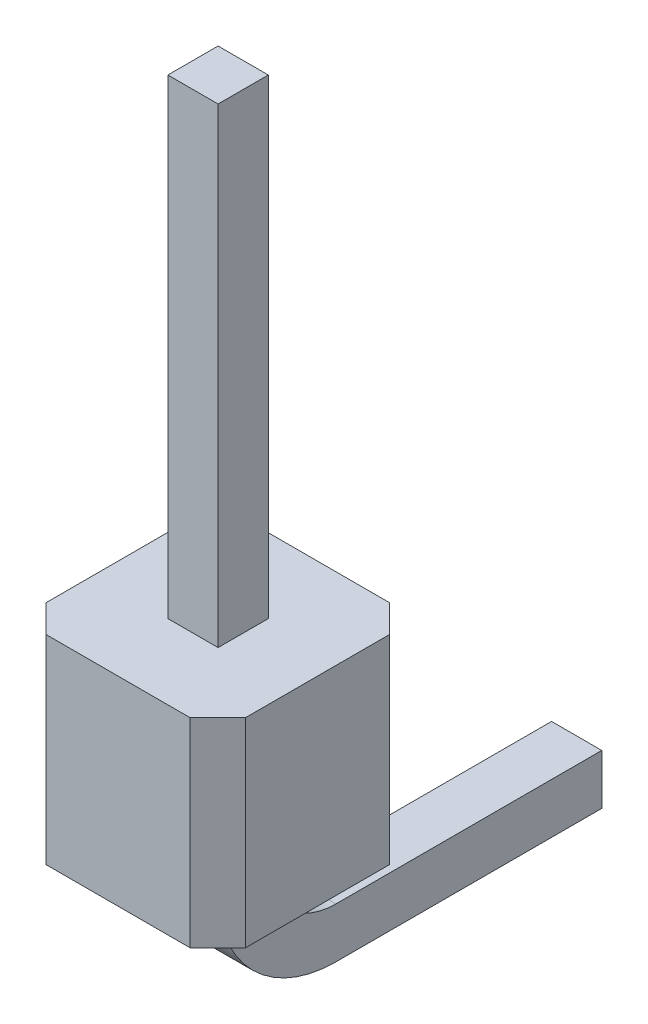
ISO-10303-21;
HEADER;
FILE_DESCRIPTION(('STEP AP214'),'2;1');
FILE_NAME('part.step','',(''),(''),'','','');
FILE_SCHEMA(('AUTOMOTIVE_DESIGN { 1 0 10303 214 1 1 1 1 }'));
ENDSEC;
DATA;
#1=APPLICATION_CONTEXT('core data for automotive mechanical design processes');
#2=APPLICATION_PROTOCOL_DEFINITION('international standard','automotive_design',2000,#1);
#3=PRODUCT_CONTEXT('',#1,'mechanical');
#4=PRODUCT('Part','Part','',(#3));
#5=PRODUCT_RELATED_PRODUCT_CATEGORY('part','',(#4));
#6=PRODUCT_DEFINITION_FORMATION('','',#4);
#7=PRODUCT_DEFINITION_CONTEXT('part definition',#1,'design');
#8=PRODUCT_DEFINITION('design','',#6,#7);
#9=PRODUCT_DEFINITION_SHAPE('','',#8);
#10=(LENGTH_UNIT() NAMED_UNIT(*) SI_UNIT(.MILLI.,.METRE.));
#11=(NAMED_UNIT(*) PLANE_ANGLE_UNIT() SI_UNIT($,.RADIAN.));
#12=(NAMED_UNIT(*) SI_UNIT($,.STERADIAN.) SOLID_ANGLE_UNIT());
#13=UNCERTAINTY_MEASURE_WITH_UNIT(LENGTH_MEASURE(1.E-05),#10,'distance_accuracy_value','');
#14=(GEOMETRIC_REPRESENTATION_CONTEXT(3) GLOBAL_UNCERTAINTY_ASSIGNED_CONTEXT((#13)) GLOBAL_UNIT_ASSIGNED_CONTEXT((#10,
#11,#12)) REPRESENTATION_CONTEXT('',''));
#15=CARTESIAN_POINT('',(0.,0.,0.));
#16=DIRECTION('',(0.,0.,1.));
#17=DIRECTION('',(1.,0.,0.));
#18=AXIS2_PLACEMENT_3D('',#15,#16,#17);
#19=CARTESIAN_POINT('',(-0.948000000000001,-0.180000000000001,-1.23844660940672));
#20=DIRECTION('',(0.,0.,1.));
#21=DIRECTION('',(1.,0.,0.));
#22=AXIS2_PLACEMENT_3D('',#19,#20,#21);
#23=PLANE('',#22);
#24=DIRECTION('',(0.,1.,0.));
#25=VECTOR('',#24,1.);
#26=CARTESIAN_POINT('',(-0.948000000000001,-0.180000000000001,-1.23844660940672));
#27=LINE('',#26,#25);
#28=CARTESIAN_POINT('',(-0.948000000000001,2.54,-1.23844660940672));
#29=VERTEX_POINT('',#28);
#30=CARTESIAN_POINT('',(-0.948000000000001,8.54,-1.23844660940672));
#31=VERTEX_POINT('',#30);
#32=EDGE_CURVE('E338',#29,#31,#27,.T.);
#33=ORIENTED_EDGE('',*,*,#32,.F.);
#34=DIRECTION('',(-1.,0.,0.));
#35=VECTOR('',#34,1.);
#36=CARTESIAN_POINT('',(0.,2.54,-1.23844660940672));
#37=LINE('',#36,#35);
#38=CARTESIAN_POINT('',(-1.588,2.54,-1.23844660940672));
#39=VERTEX_POINT('',#38);
#40=EDGE_CURVE('E200',#29,#39,#37,.T.);
#41=ORIENTED_EDGE('',*,*,#40,.T.);
#42=DIRECTION('',(0.,1.,0.));
#43=VECTOR('',#42,1.);
#44=CARTESIAN_POINT('',(-1.588,-0.180000000000001,-1.23844660940672));
#45=LINE('',#44,#43);
#46=CARTESIAN_POINT('',(-1.588,8.54,-1.23844660940672));
#47=VERTEX_POINT('',#46);
#48=EDGE_CURVE('E292',#39,#47,#45,.T.);
#49=ORIENTED_EDGE('',*,*,#48,.T.);
#50=DIRECTION('',(-1.,0.,0.));
#51=VECTOR('',#50,1.);
#52=CARTESIAN_POINT('',(-0.948000000000001,8.54,-1.23844660940672));
#53=LINE('',#52,#51);
#54=EDGE_CURVE('E308',#31,#47,#53,.T.);
#55=ORIENTED_EDGE('',*,*,#54,.F.);
#56=EDGE_LOOP('',(#33,#41,#49,#55));
#57=FACE_BOUND('',#56,.T.);
#58=ADVANCED_FACE('F37',(#57),#23,.F.);
#59=CARTESIAN_POINT('',(-0.948000000000001,-0.180000000000001,-2.09844660940673));
#60=DIRECTION('',(1.,0.,0.));
#61=DIRECTION('',(0.,0.,-1.));
#62=AXIS2_PLACEMENT_3D('',#59,#60,#61);
#63=PLANE('',#62);
#64=DIRECTION('',(0.,0.,1.));
#65=VECTOR('',#64,1.);
#66=CARTESIAN_POINT('',(-0.948000000000001,2.54,0.));
#67=LINE('',#66,#65);
#68=CARTESIAN_POINT('',(-0.948000000000001,2.54,-0.598446609406725));
#69=VERTEX_POINT('',#68);
#70=EDGE_CURVE('E197',#29,#69,#67,.T.);
#71=ORIENTED_EDGE('',*,*,#70,.F.);
#72=ORIENTED_EDGE('',*,*,#32,.T.);
#73=DIRECTION('',(0.,0.,1.));
#74=VECTOR('',#73,1.);
#75=CARTESIAN_POINT('',(-0.948000000000001,8.54,-1.23844660940672));
#76=LINE('',#75,#74);
#77=CARTESIAN_POINT('',(-0.948000000000001,8.54,-0.598446609406724));
#78=VERTEX_POINT('',#77);
#79=EDGE_CURVE('E334',#31,#78,#76,.T.);
#80=ORIENTED_EDGE('',*,*,#79,.T.);
#81=DIRECTION('',(0.,-1.,0.));
#82=VECTOR('',#81,1.);
#83=CARTESIAN_POINT('',(-0.948000000000001,8.54,-0.598446609406724));
#84=LINE('',#83,#82);
#85=EDGE_CURVE('E305',#78,#69,#84,.T.);
#86=ORIENTED_EDGE('',*,*,#85,.T.);
#87=EDGE_LOOP('',(#71,#72,#80,#86));
#88=FACE_BOUND('',#87,.T.);
#89=ADVANCED_FACE('F353',(#88),#63,.T.);
#90=CARTESIAN_POINT('',(-0.948000000000001,8.54,-0.598446609406724));
#91=DIRECTION('',(0.,0.,-1.));
#92=DIRECTION('',(0.,1.,0.));
#93=AXIS2_PLACEMENT_3D('',#90,#91,#92);
#94=PLANE('',#93);
#95=DIRECTION('',(0.,-1.,0.));
#96=VECTOR('',#95,1.);
#97=CARTESIAN_POINT('',(-1.588,8.54,-0.598446609406724));
#98=LINE('',#97,#96);
#99=CARTESIAN_POINT('',(-1.588,8.54,-0.598446609406724));
#100=VERTEX_POINT('',#99);
#101=CARTESIAN_POINT('',(-1.588,2.54,-0.598446609406725));
#102=VERTEX_POINT('',#101);
#103=EDGE_CURVE('E192',#100,#102,#98,.T.);
#104=ORIENTED_EDGE('',*,*,#103,.T.);
#105=DIRECTION('',(-1.,0.,0.));
#106=VECTOR('',#105,1.);
#107=CARTESIAN_POINT('',(-1.588,2.54,-0.598446609406725));
#108=LINE('',#107,#106);
#109=EDGE_CURVE('E208',#69,#102,#108,.T.);
#110=ORIENTED_EDGE('',*,*,#109,.F.);
#111=ORIENTED_EDGE('',*,*,#85,.F.);
#112=DIRECTION('',(-1.,0.,0.));
#113=VECTOR('',#112,1.);
#114=CARTESIAN_POINT('',(-0.948000000000001,8.54,-0.598446609406724));
#115=LINE('',#114,#113);
#116=EDGE_CURVE('E304',#78,#100,#115,.T.);
#117=ORIENTED_EDGE('',*,*,#116,.T.);
#118=EDGE_LOOP('',(#104,#110,#111,#117));
#119=FACE_BOUND('',#118,.T.);
#120=ADVANCED_FACE('F359',(#119),#94,.F.);
#121=CARTESIAN_POINT('',(-1.588,-0.180000000000001,-2.09844660940673));
#122=DIRECTION('',(1.,0.,0.));
#123=DIRECTION('',(0.,0.,-1.));
#124=AXIS2_PLACEMENT_3D('',#121,#122,#123);
#125=PLANE('',#124);
#126=ORIENTED_EDGE('',*,*,#48,.F.);
#127=DIRECTION('',(0.,0.,-1.));
#128=VECTOR('',#127,1.);
#129=CARTESIAN_POINT('',(-1.588,2.54,-1.23444660940673));
#130=LINE('',#129,#128);
#131=EDGE_CURVE('E211',#102,#39,#130,.T.);
#132=ORIENTED_EDGE('',*,*,#131,.F.);
#133=ORIENTED_EDGE('',*,*,#103,.F.);
#134=DIRECTION('',(0.,0.,1.));
#135=VECTOR('',#134,1.);
#136=CARTESIAN_POINT('',(-1.588,8.54,-1.23844660940672));
#137=LINE('',#136,#135);
#138=EDGE_CURVE('E291',#47,#100,#137,.T.);
#139=ORIENTED_EDGE('',*,*,#138,.F.);
#140=EDGE_LOOP('',(#126,#132,#133,#139));
#141=FACE_BOUND('',#140,.T.);
#142=ADVANCED_FACE('F376',(#141),#125,.F.);
#143=CARTESIAN_POINT('',(-0.948000000000001,8.54,-1.23844660940672));
#144=DIRECTION('',(0.,-1.,0.));
#145=DIRECTION('',(0.,0.,-1.));
#146=AXIS2_PLACEMENT_3D('',#143,#144,#145);
#147=PLANE('',#146);
#148=ORIENTED_EDGE('',*,*,#138,.T.);
#149=ORIENTED_EDGE('',*,*,#116,.F.);
#150=ORIENTED_EDGE('',*,*,#79,.F.);
#151=ORIENTED_EDGE('',*,*,#54,.T.);
#152=EDGE_LOOP('',(#148,#149,#150,#151));
#153=FACE_BOUND('',#152,.T.);
#154=ADVANCED_FACE('F382',(#153),#147,.F.);
#155=CARTESIAN_POINT('',(0.,2.54,0.));
#156=DIRECTION('',(0.,-1.,0.));
#157=DIRECTION('',(0.,0.,-1.));
#158=AXIS2_PLACEMENT_3D('',#155,#156,#157);
#159=PLANE('',#158);
#160=DIRECTION('',(0.707106781186543,0.,0.707106781186552));
#161=VECTOR('',#160,1.);
#162=CARTESIAN_POINT('',(-0.353553390593271,2.54,-2.18644660940673));
#163=LINE('',#162,#161);
#164=CARTESIAN_POINT('',(-0.353553390593271,2.54,-2.18644660940673));
#165=VERTEX_POINT('',#164);
#166=CARTESIAN_POINT('',(0.,2.54,-1.83289321881345));
#167=VERTEX_POINT('',#166);
#168=EDGE_CURVE('E217',#165,#167,#163,.T.);
#169=ORIENTED_EDGE('',*,*,#168,.F.);
#170=DIRECTION('',(1.,0.,0.));
#171=VECTOR('',#170,1.);
#172=CARTESIAN_POINT('',(-0.353553390593271,2.54,-2.18644660940673));
#173=LINE('',#172,#171);
#174=CARTESIAN_POINT('',(-2.18644660940673,2.54,-2.18644660940673));
#175=VERTEX_POINT('',#174);
#176=EDGE_CURVE('E239',#175,#165,#173,.T.);
#177=ORIENTED_EDGE('',*,*,#176,.F.);
#178=DIRECTION('',(0.707106781186544,0.,-0.707106781186551));
#179=VECTOR('',#178,1.);
#180=CARTESIAN_POINT('',(-2.54,2.54,-1.83289321881345));
#181=LINE('',#180,#179);
#182=CARTESIAN_POINT('',(-2.54,2.54,-1.83289321881345));
#183=VERTEX_POINT('',#182);
#184=EDGE_CURVE('E236',#183,#175,#181,.T.);
#185=ORIENTED_EDGE('',*,*,#184,.F.);
#186=DIRECTION('',(0.,0.,-1.));
#187=VECTOR('',#186,1.);
#188=CARTESIAN_POINT('',(-2.54000000000001,2.54,0.));
#189=LINE('',#188,#187);
#190=CARTESIAN_POINT('',(-2.54000000000001,2.54,0.));
#191=VERTEX_POINT('',#190);
#192=EDGE_CURVE('E233',#191,#183,#189,.T.);
#193=ORIENTED_EDGE('',*,*,#192,.F.);
#194=DIRECTION('',(-0.707106781186541,0.,-0.707106781186554));
#195=VECTOR('',#194,1.);
#196=CARTESIAN_POINT('',(-2.18644660940674,2.54,0.353553390593279));
#197=LINE('',#196,#195);
#198=CARTESIAN_POINT('',(-2.18644660940674,2.54,0.353553390593279));
#199=VERTEX_POINT('',#198);
#200=EDGE_CURVE('E230',#199,#191,#197,.T.);
#201=ORIENTED_EDGE('',*,*,#200,.F.);
#202=DIRECTION('',(-1.,0.,0.));
#203=VECTOR('',#202,1.);
#204=CARTESIAN_POINT('',(-0.353553390593275,2.54,0.35355339059327));
#205=LINE('',#204,#203);
#206=CARTESIAN_POINT('',(-0.353553390593275,2.54,0.35355339059327));
#207=VERTEX_POINT('',#206);
#208=EDGE_CURVE('E227',#207,#199,#205,.T.);
#209=ORIENTED_EDGE('',*,*,#208,.F.);
#210=DIRECTION('',(-0.707106781186552,0.,0.707106781186542));
#211=VECTOR('',#210,1.);
#212=CARTESIAN_POINT('',(0.,2.54,0.));
#213=LINE('',#212,#211);
#214=CARTESIAN_POINT('',(0.,2.54,0.));
#215=VERTEX_POINT('',#214);
#216=EDGE_CURVE('E224',#215,#207,#213,.T.);
#217=ORIENTED_EDGE('',*,*,#216,.F.);
#218=DIRECTION('',(0.,0.,1.));
#219=VECTOR('',#218,1.);
#220=CARTESIAN_POINT('',(0.,2.54,0.));
#221=LINE('',#220,#219);
#222=EDGE_CURVE('E220',#167,#215,#221,.T.);
#223=ORIENTED_EDGE('',*,*,#222,.F.);
#224=EDGE_LOOP('',(#169,#177,#185,#193,#201,#209,#217,#223));
#225=FACE_BOUND('',#224,.T.);
#226=ORIENTED_EDGE('',*,*,#70,.T.);
#227=ORIENTED_EDGE('',*,*,#109,.T.);
#228=ORIENTED_EDGE('',*,*,#131,.T.);
#229=ORIENTED_EDGE('',*,*,#40,.F.);
#230=EDGE_LOOP('',(#226,#227,#228,#229));
#231=FACE_BOUND('',#230,.T.);
#232=ADVANCED_FACE('F389',(#225,#231),#159,.F.);
#233=CARTESIAN_POINT('',(0.,0.,0.));
#234=DIRECTION('',(0.,-1.,0.));
#235=DIRECTION('',(0.,0.,-1.));
#236=AXIS2_PLACEMENT_3D('',#233,#234,#235);
#237=PLANE('',#236);
#238=DIRECTION('',(0.707106781186543,0.,0.707106781186552));
#239=VECTOR('',#238,1.);
#240=CARTESIAN_POINT('',(-0.353553390593271,0.,-2.18644660940673));
#241=LINE('',#240,#239);
#242=CARTESIAN_POINT('',(-0.353553390593271,0.,-2.18644660940673));
#243=VERTEX_POINT('',#242);
#244=CARTESIAN_POINT('',(0.,0.,-1.83289321881345));
#245=VERTEX_POINT('',#244);
#246=EDGE_CURVE('E214',#243,#245,#241,.T.);
#247=ORIENTED_EDGE('',*,*,#246,.T.);
#248=DIRECTION('',(0.,0.,1.));
#249=VECTOR('',#248,1.);
#250=CARTESIAN_POINT('',(0.,0.,0.));
#251=LINE('',#250,#249);
#252=CARTESIAN_POINT('',(0.,0.,0.));
#253=VERTEX_POINT('',#252);
#254=EDGE_CURVE('E245',#245,#253,#251,.T.);
#255=ORIENTED_EDGE('',*,*,#254,.T.);
#256=DIRECTION('',(-0.707106781186552,0.,0.707106781186542));
#257=VECTOR('',#256,1.);
#258=CARTESIAN_POINT('',(0.,0.,0.));
#259=LINE('',#258,#257);
#260=CARTESIAN_POINT('',(-0.353553390593275,0.,0.35355339059327));
#261=VERTEX_POINT('',#260);
#262=EDGE_CURVE('E248',#253,#261,#259,.T.);
#263=ORIENTED_EDGE('',*,*,#262,.T.);
#264=DIRECTION('',(-1.,0.,0.));
#265=VECTOR('',#264,1.);
#266=CARTESIAN_POINT('',(-0.353553390593275,0.,0.35355339059327));
#267=LINE('',#266,#265);
#268=CARTESIAN_POINT('',(-2.18644660940674,0.,0.353553390593279));
#269=VERTEX_POINT('',#268);
#270=EDGE_CURVE('E251',#261,#269,#267,.T.);
#271=ORIENTED_EDGE('',*,*,#270,.T.);
#272=DIRECTION('',(-0.707106781186541,0.,-0.707106781186554));
#273=VECTOR('',#272,1.);
#274=CARTESIAN_POINT('',(-2.18644660940674,0.,0.353553390593279));
#275=LINE('',#274,#273);
#276=CARTESIAN_POINT('',(-2.54000000000001,0.,0.));
#277=VERTEX_POINT('',#276);
#278=EDGE_CURVE('E254',#269,#277,#275,.T.);
#279=ORIENTED_EDGE('',*,*,#278,.T.);
#280=DIRECTION('',(0.,0.,-1.));
#281=VECTOR('',#280,1.);
#282=CARTESIAN_POINT('',(-2.54000000000001,0.,0.));
#283=LINE('',#282,#281);
#284=CARTESIAN_POINT('',(-2.54,0.,-1.83289321881345));
#285=VERTEX_POINT('',#284);
#286=EDGE_CURVE('E257',#277,#285,#283,.T.);
#287=ORIENTED_EDGE('',*,*,#286,.T.);
#288=DIRECTION('',(0.707106781186544,0.,-0.707106781186551));
#289=VECTOR('',#288,1.);
#290=CARTESIAN_POINT('',(-2.54,0.,-1.83289321881345));
#291=LINE('',#290,#289);
#292=CARTESIAN_POINT('',(-2.18644660940673,0.,-2.18644660940673));
#293=VERTEX_POINT('',#292);
#294=EDGE_CURVE('E260',#285,#293,#291,.T.);
#295=ORIENTED_EDGE('',*,*,#294,.T.);
#296=DIRECTION('',(1.,0.,0.));
#297=VECTOR('',#296,1.);
#298=CARTESIAN_POINT('',(-0.353553390593271,0.,-2.18644660940673));
#299=LINE('',#298,#297);
#300=EDGE_CURVE('E221',#293,#243,#299,.T.);
#301=ORIENTED_EDGE('',*,*,#300,.T.);
#302=EDGE_LOOP('',(#247,#255,#263,#271,#279,#287,#295,#301));
#303=FACE_BOUND('',#302,.T.);
#304=DIRECTION('',(-1.,0.,0.));
#305=VECTOR('',#304,1.);
#306=CARTESIAN_POINT('',(-1.588,0.,-0.598446609406725));
#307=LINE('',#306,#305);
#308=CARTESIAN_POINT('',(-0.948000000000001,0.,-0.598446609406724));
#309=VERTEX_POINT('',#308);
#310=CARTESIAN_POINT('',(-1.588,0.,-0.598446609406725));
#311=VERTEX_POINT('',#310);
#312=EDGE_CURVE('E52',#309,#311,#307,.T.);
#313=ORIENTED_EDGE('',*,*,#312,.F.);
#314=DIRECTION('',(0.,0.,1.));
#315=VECTOR('',#314,1.);
#316=CARTESIAN_POINT('',(-0.948000000000001,0.,0.));
#317=LINE('',#316,#315);
#318=CARTESIAN_POINT('',(-0.948000000000001,0.,-1.23844660940672));
#319=VERTEX_POINT('',#318);
#320=EDGE_CURVE('E11',#319,#309,#317,.T.);
#321=ORIENTED_EDGE('',*,*,#320,.F.);
#322=DIRECTION('',(-1.,0.,0.));
#323=VECTOR('',#322,1.);
#324=CARTESIAN_POINT('',(0.,0.,-1.23844660940672));
#325=LINE('',#324,#323);
#326=CARTESIAN_POINT('',(-1.588,0.,-1.23844660940672));
#327=VERTEX_POINT('',#326);
#328=EDGE_CURVE('E45',#319,#327,#325,.T.);
#329=ORIENTED_EDGE('',*,*,#328,.T.);
#330=DIRECTION('',(0.,0.,-1.));
#331=VECTOR('',#330,1.);
#332=CARTESIAN_POINT('',(-1.588,0.,-1.23444660940673));
#333=LINE('',#332,#331);
#334=EDGE_CURVE('E212',#311,#327,#333,.T.);
#335=ORIENTED_EDGE('',*,*,#334,.F.);
#336=EDGE_LOOP('',(#313,#321,#329,#335));
#337=FACE_BOUND('',#336,.T.);
#338=ADVANCED_FACE('F280',(#303,#337),#237,.T.);
#339=CARTESIAN_POINT('',(-0.353553390593271,2.54,-2.18644660940673));
#340=DIRECTION('',(0.707106781186552,0.,-0.707106781186543));
#341=DIRECTION('',(-0.707106781186543,0.,-0.707106781186552));
#342=AXIS2_PLACEMENT_3D('',#339,#340,#341);
#343=PLANE('',#342);
#344=ORIENTED_EDGE('',*,*,#246,.F.);
#345=DIRECTION('',(0.,-1.,0.));
#346=VECTOR('',#345,1.);
#347=CARTESIAN_POINT('',(-0.353553390593271,2.54,-2.18644660940673));
#348=LINE('',#347,#346);
#349=EDGE_CURVE('E265',#165,#243,#348,.T.);
#350=ORIENTED_EDGE('',*,*,#349,.F.);
#351=ORIENTED_EDGE('',*,*,#168,.T.);
#352=DIRECTION('',(0.,-1.,0.));
#353=VECTOR('',#352,1.);
#354=CARTESIAN_POINT('',(0.,2.54,-1.83289321881345));
#355=LINE('',#354,#353);
#356=EDGE_CURVE('E242',#167,#245,#355,.T.);
#357=ORIENTED_EDGE('',*,*,#356,.T.);
#358=EDGE_LOOP('',(#344,#350,#351,#357));
#359=FACE_BOUND('',#358,.T.);
#360=ADVANCED_FACE('F39',(#359),#343,.T.);
#361=CARTESIAN_POINT('',(-0.353553390593271,2.54,-2.18644660940673));
#362=DIRECTION('',(0.,0.,-1.));
#363=DIRECTION('',(-1.,0.,0.));
#364=AXIS2_PLACEMENT_3D('',#361,#362,#363);
#365=PLANE('',#364);
#366=ORIENTED_EDGE('',*,*,#300,.F.);
#367=DIRECTION('',(0.,-1.,0.));
#368=VECTOR('',#367,1.);
#369=CARTESIAN_POINT('',(-2.18644660940673,2.54,-2.18644660940673));
#370=LINE('',#369,#368);
#371=EDGE_CURVE('E267',#175,#293,#370,.T.);
#372=ORIENTED_EDGE('',*,*,#371,.F.);
#373=ORIENTED_EDGE('',*,*,#176,.T.);
#374=ORIENTED_EDGE('',*,*,#349,.T.);
#375=EDGE_LOOP('',(#366,#372,#373,#374));
#376=FACE_BOUND('',#375,.T.);
#377=ADVANCED_FACE('F409',(#376),#365,.T.);
#378=CARTESIAN_POINT('',(-2.54,2.54,-1.83289321881345));
#379=DIRECTION('',(-0.707106781186551,0.,-0.707106781186544));
#380=DIRECTION('',(-0.707106781186544,0.,0.707106781186551));
#381=AXIS2_PLACEMENT_3D('',#378,#379,#380);
#382=PLANE('',#381);
#383=ORIENTED_EDGE('',*,*,#294,.F.);
#384=DIRECTION('',(0.,-1.,0.));
#385=VECTOR('',#384,1.);
#386=CARTESIAN_POINT('',(-2.54,2.54,-1.83289321881345));
#387=LINE('',#386,#385);
#388=EDGE_CURVE('E269',#183,#285,#387,.T.);
#389=ORIENTED_EDGE('',*,*,#388,.F.);
#390=ORIENTED_EDGE('',*,*,#184,.T.);
#391=ORIENTED_EDGE('',*,*,#371,.T.);
#392=EDGE_LOOP('',(#383,#389,#390,#391));
#393=FACE_BOUND('',#392,.T.);
#394=ADVANCED_FACE('F412',(#393),#382,.T.);
#395=CARTESIAN_POINT('',(-2.54000000000001,2.54,0.));
#396=DIRECTION('',(-1.,0.,0.));
#397=DIRECTION('',(0.,0.,1.));
#398=AXIS2_PLACEMENT_3D('',#395,#396,#397);
#399=PLANE('',#398);
#400=ORIENTED_EDGE('',*,*,#286,.F.);
#401=DIRECTION('',(0.,-1.,0.));
#402=VECTOR('',#401,1.);
#403=CARTESIAN_POINT('',(-2.54000000000001,2.54,0.));
#404=LINE('',#403,#402);
#405=EDGE_CURVE('E271',#191,#277,#404,.T.);
#406=ORIENTED_EDGE('',*,*,#405,.F.);
#407=ORIENTED_EDGE('',*,*,#192,.T.);
#408=ORIENTED_EDGE('',*,*,#388,.T.);
#409=EDGE_LOOP('',(#400,#406,#407,#408));
#410=FACE_BOUND('',#409,.T.);
#411=ADVANCED_FACE('F416',(#410),#399,.T.);
#412=CARTESIAN_POINT('',(-2.18644660940674,2.54,0.353553390593279));
#413=DIRECTION('',(-0.707106781186554,0.,0.707106781186541));
#414=DIRECTION('',(0.707106781186541,0.,0.707106781186554));
#415=AXIS2_PLACEMENT_3D('',#412,#413,#414);
#416=PLANE('',#415);
#417=ORIENTED_EDGE('',*,*,#278,.F.);
#418=DIRECTION('',(0.,-1.,0.));
#419=VECTOR('',#418,1.);
#420=CARTESIAN_POINT('',(-2.18644660940674,2.54,0.353553390593279));
#421=LINE('',#420,#419);
#422=EDGE_CURVE('E273',#199,#269,#421,.T.);
#423=ORIENTED_EDGE('',*,*,#422,.F.);
#424=ORIENTED_EDGE('',*,*,#200,.T.);
#425=ORIENTED_EDGE('',*,*,#405,.T.);
#426=EDGE_LOOP('',(#417,#423,#424,#425));
#427=FACE_BOUND('',#426,.T.);
#428=ADVANCED_FACE('F420',(#427),#416,.T.);
#429=CARTESIAN_POINT('',(-0.353553390593275,2.54,0.35355339059327));
#430=DIRECTION('',(0.,0.,1.));
#431=DIRECTION('',(1.,0.,0.));
#432=AXIS2_PLACEMENT_3D('',#429,#430,#431);
#433=PLANE('',#432);
#434=ORIENTED_EDGE('',*,*,#270,.F.);
#435=DIRECTION('',(0.,-1.,0.));
#436=VECTOR('',#435,1.);
#437=CARTESIAN_POINT('',(-0.353553390593275,2.54,0.35355339059327));
#438=LINE('',#437,#436);
#439=EDGE_CURVE('E275',#207,#261,#438,.T.);
#440=ORIENTED_EDGE('',*,*,#439,.F.);
#441=ORIENTED_EDGE('',*,*,#208,.T.);
#442=ORIENTED_EDGE('',*,*,#422,.T.);
#443=EDGE_LOOP('',(#434,#440,#441,#442));
#444=FACE_BOUND('',#443,.T.);
#445=ADVANCED_FACE('F424',(#444),#433,.T.);
#446=CARTESIAN_POINT('',(0.,2.54,0.));
#447=DIRECTION('',(0.707106781186543,0.,0.707106781186553));
#448=DIRECTION('',(0.707106781186553,0.,-0.707106781186543));
#449=AXIS2_PLACEMENT_3D('',#446,#447,#448);
#450=PLANE('',#449);
#451=ORIENTED_EDGE('',*,*,#262,.F.);
#452=DIRECTION('',(0.,-1.,0.));
#453=VECTOR('',#452,1.);
#454=CARTESIAN_POINT('',(0.,2.54,0.));
#455=LINE('',#454,#453);
#456=EDGE_CURVE('E277',#215,#253,#455,.T.);
#457=ORIENTED_EDGE('',*,*,#456,.F.);
#458=ORIENTED_EDGE('',*,*,#216,.T.);
#459=ORIENTED_EDGE('',*,*,#439,.T.);
#460=EDGE_LOOP('',(#451,#457,#458,#459));
#461=FACE_BOUND('',#460,.T.);
#462=ADVANCED_FACE('F428',(#461),#450,.T.);
#463=CARTESIAN_POINT('',(0.,2.54,0.));
#464=DIRECTION('',(1.,0.,0.));
#465=DIRECTION('',(0.,0.,-1.));
#466=AXIS2_PLACEMENT_3D('',#463,#464,#465);
#467=PLANE('',#466);
#468=ORIENTED_EDGE('',*,*,#254,.F.);
#469=ORIENTED_EDGE('',*,*,#356,.F.);
#470=ORIENTED_EDGE('',*,*,#222,.T.);
#471=ORIENTED_EDGE('',*,*,#456,.T.);
#472=EDGE_LOOP('',(#468,#469,#470,#471));
#473=FACE_BOUND('',#472,.T.);
#474=ADVANCED_FACE('F431',(#473),#467,.T.);
#475=CARTESIAN_POINT('',(-0.948000000000001,-0.180000000000001,-2.09844660940673));
#476=DIRECTION('',(-1.,0.,0.));
#477=DIRECTION('',(0.,0.,1.));
#478=AXIS2_PLACEMENT_3D('',#475,#476,#477);
#479=CYLINDRICAL_SURFACE('',#478,1.5);
#480=CARTESIAN_POINT('',(-1.588,-0.180000000000001,-2.09844660940673));
#481=DIRECTION('',(1.,0.,0.));
#482=DIRECTION('',(0.,0.,-1.));
#483=AXIS2_PLACEMENT_3D('',#480,#481,#482);
#484=CIRCLE('',#483,1.5);
#485=CARTESIAN_POINT('',(-1.588,-0.180000000000001,-0.598446609406725));
#486=VERTEX_POINT('',#485);
#487=CARTESIAN_POINT('',(-1.588,-1.68,-2.09844660940673));
#488=VERTEX_POINT('',#487);
#489=EDGE_CURVE('E196',#486,#488,#484,.T.);
#490=ORIENTED_EDGE('',*,*,#489,.T.);
#491=DIRECTION('',(-1.,0.,0.));
#492=VECTOR('',#491,1.);
#493=CARTESIAN_POINT('',(-0.948000000000001,-1.68,-2.09844660940673));
#494=LINE('',#493,#492);
#495=CARTESIAN_POINT('',(-0.948000000000001,-1.68,-2.09844660940673));
#496=VERTEX_POINT('',#495);
#497=EDGE_CURVE('E175',#496,#488,#494,.T.);
#498=ORIENTED_EDGE('',*,*,#497,.F.);
#499=CARTESIAN_POINT('',(-0.948000000000001,-0.180000000000001,-2.09844660940673));
#500=DIRECTION('',(1.,0.,0.));
#501=DIRECTION('',(0.,0.,-1.));
#502=AXIS2_PLACEMENT_3D('',#499,#500,#501);
#503=CIRCLE('',#502,1.5);
#504=CARTESIAN_POINT('',(-0.948000000000001,-0.180000000000001,-0.598446609406725));
#505=VERTEX_POINT('',#504);
#506=EDGE_CURVE('E182',#505,#496,#503,.T.);
#507=ORIENTED_EDGE('',*,*,#506,.F.);
#508=DIRECTION('',(-1.,0.,0.));
#509=VECTOR('',#508,1.);
#510=CARTESIAN_POINT('',(-0.948000000000001,-0.180000000000001,-0.598446609406725));
#511=LINE('',#510,#509);
#512=EDGE_CURVE('E302',#505,#486,#511,.T.);
#513=ORIENTED_EDGE('',*,*,#512,.T.);
#514=EDGE_LOOP('',(#490,#498,#507,#513));
#515=FACE_BOUND('',#514,.T.);
#516=ADVANCED_FACE('F194',(#515),#479,.T.);
#517=CARTESIAN_POINT('',(-0.948000000000001,-1.68,-5.48844660940673));
#518=DIRECTION('',(0.,1.,0.));
#519=DIRECTION('',(0.,0.,1.));
#520=AXIS2_PLACEMENT_3D('',#517,#518,#519);
#521=PLANE('',#520);
#522=DIRECTION('',(0.,0.,-1.));
#523=VECTOR('',#522,1.);
#524=CARTESIAN_POINT('',(-1.588,-1.68,-5.48844660940673));
#525=LINE('',#524,#523);
#526=CARTESIAN_POINT('',(-1.588,-1.68,-5.48844660940673));
#527=VERTEX_POINT('',#526);
#528=EDGE_CURVE('E327',#488,#527,#525,.T.);
#529=ORIENTED_EDGE('',*,*,#528,.T.);
#530=DIRECTION('',(-1.,0.,0.));
#531=VECTOR('',#530,1.);
#532=CARTESIAN_POINT('',(-0.948000000000001,-1.68,-5.48844660940673));
#533=LINE('',#532,#531);
#534=CARTESIAN_POINT('',(-0.948000000000001,-1.68,-5.48844660940673));
#535=VERTEX_POINT('',#534);
#536=EDGE_CURVE('E178',#535,#527,#533,.T.);
#537=ORIENTED_EDGE('',*,*,#536,.F.);
#538=DIRECTION('',(0.,0.,-1.));
#539=VECTOR('',#538,1.);
#540=CARTESIAN_POINT('',(-0.948000000000001,-1.68,-5.48844660940673));
#541=LINE('',#540,#539);
#542=EDGE_CURVE('E171',#496,#535,#541,.T.);
#543=ORIENTED_EDGE('',*,*,#542,.F.);
#544=ORIENTED_EDGE('',*,*,#497,.T.);
#545=EDGE_LOOP('',(#529,#537,#543,#544));
#546=FACE_BOUND('',#545,.T.);
#547=ADVANCED_FACE('F173',(#546),#521,.F.);
#548=CARTESIAN_POINT('',(-0.948000000000001,-1.04,-5.48844660940673));
#549=DIRECTION('',(0.,0.,1.));
#550=DIRECTION('',(1.,0.,0.));
#551=AXIS2_PLACEMENT_3D('',#548,#549,#550);
#552=PLANE('',#551);
#553=DIRECTION('',(0.,1.,0.));
#554=VECTOR('',#553,1.);
#555=CARTESIAN_POINT('',(-1.588,-1.04,-5.48844660940673));
#556=LINE('',#555,#554);
#557=CARTESIAN_POINT('',(-1.588,-1.04,-5.48844660940673));
#558=VERTEX_POINT('',#557);
#559=EDGE_CURVE('E326',#527,#558,#556,.T.);
#560=ORIENTED_EDGE('',*,*,#559,.T.);
#561=DIRECTION('',(-1.,0.,0.));
#562=VECTOR('',#561,1.);
#563=CARTESIAN_POINT('',(-0.948000000000001,-1.04,-5.48844660940673));
#564=LINE('',#563,#562);
#565=CARTESIAN_POINT('',(-0.948000000000001,-1.04,-5.48844660940673));
#566=VERTEX_POINT('',#565);
#567=EDGE_CURVE('E202',#566,#558,#564,.T.);
#568=ORIENTED_EDGE('',*,*,#567,.F.);
#569=DIRECTION('',(0.,1.,0.));
#570=VECTOR('',#569,1.);
#571=CARTESIAN_POINT('',(-0.948000000000001,-1.04,-5.48844660940673));
#572=LINE('',#571,#570);
#573=EDGE_CURVE('E181',#535,#566,#572,.T.);
#574=ORIENTED_EDGE('',*,*,#573,.F.);
#575=ORIENTED_EDGE('',*,*,#536,.T.);
#576=EDGE_LOOP('',(#560,#568,#574,#575));
#577=FACE_BOUND('',#576,.T.);
#578=ADVANCED_FACE('F342',(#577),#552,.F.);
#579=CARTESIAN_POINT('',(-0.948000000000001,-1.04,-2.09844660940673));
#580=DIRECTION('',(0.,-1.,0.));
#581=DIRECTION('',(0.,0.,-1.));
#582=AXIS2_PLACEMENT_3D('',#579,#580,#581);
#583=PLANE('',#582);
#584=DIRECTION('',(0.,0.,1.));
#585=VECTOR('',#584,1.);
#586=CARTESIAN_POINT('',(-1.588,-1.04,-2.09844660940673));
#587=LINE('',#586,#585);
#588=CARTESIAN_POINT('',(-1.588,-1.04,-2.09844660940673));
#589=VERTEX_POINT('',#588);
#590=EDGE_CURVE('E321',#558,#589,#587,.T.);
#591=ORIENTED_EDGE('',*,*,#590,.T.);
#592=DIRECTION('',(-1.,0.,0.));
#593=VECTOR('',#592,1.);
#594=CARTESIAN_POINT('',(-0.948000000000001,-1.04,-2.09844660940673));
#595=LINE('',#594,#593);
#596=CARTESIAN_POINT('',(-0.948000000000001,-1.04,-2.09844660940673));
#597=VERTEX_POINT('',#596);
#598=EDGE_CURVE('E312',#597,#589,#595,.T.);
#599=ORIENTED_EDGE('',*,*,#598,.F.);
#600=DIRECTION('',(0.,0.,1.));
#601=VECTOR('',#600,1.);
#602=CARTESIAN_POINT('',(-0.948000000000001,-1.04,-2.09844660940673));
#603=LINE('',#602,#601);
#604=EDGE_CURVE('E322',#566,#597,#603,.T.);
#605=ORIENTED_EDGE('',*,*,#604,.F.);
#606=ORIENTED_EDGE('',*,*,#567,.T.);
#607=EDGE_LOOP('',(#591,#599,#605,#606));
#608=FACE_BOUND('',#607,.T.);
#609=ADVANCED_FACE('F319',(#608),#583,.F.);
#610=CARTESIAN_POINT('',(-0.948000000000001,-0.180000000000001,-2.09844660940673));
#611=DIRECTION('',(-1.,0.,0.));
#612=DIRECTION('',(0.,0.,1.));
#613=AXIS2_PLACEMENT_3D('',#610,#611,#612);
#614=CYLINDRICAL_SURFACE('',#613,0.860000000000001);
#615=CARTESIAN_POINT('',(-1.588,-0.180000000000001,-2.09844660940673));
#616=DIRECTION('',(-1.,0.,0.));
#617=DIRECTION('',(0.,0.,1.));
#618=AXIS2_PLACEMENT_3D('',#615,#616,#617);
#619=CIRCLE('',#618,0.860000000000001);
#620=CARTESIAN_POINT('',(-1.588,-0.180000000000001,-1.23844660940672));
#621=VERTEX_POINT('',#620);
#622=EDGE_CURVE('E296',#589,#621,#619,.T.);
#623=ORIENTED_EDGE('',*,*,#622,.T.);
#624=DIRECTION('',(-1.,0.,0.));
#625=VECTOR('',#624,1.);
#626=CARTESIAN_POINT('',(-0.948000000000001,-0.180000000000001,-1.23844660940672));
#627=LINE('',#626,#625);
#628=CARTESIAN_POINT('',(-0.948000000000001,-0.180000000000001,-1.23844660940672));
#629=VERTEX_POINT('',#628);
#630=EDGE_CURVE('E288',#629,#621,#627,.T.);
#631=ORIENTED_EDGE('',*,*,#630,.F.);
#632=CARTESIAN_POINT('',(-0.948000000000001,-0.180000000000001,-2.09844660940673));
#633=DIRECTION('',(-1.,0.,0.));
#634=DIRECTION('',(0.,0.,1.));
#635=AXIS2_PLACEMENT_3D('',#632,#633,#634);
#636=CIRCLE('',#635,0.860000000000001);
#637=EDGE_CURVE('E339',#597,#629,#636,.T.);
#638=ORIENTED_EDGE('',*,*,#637,.F.);
#639=ORIENTED_EDGE('',*,*,#598,.T.);
#640=EDGE_LOOP('',(#623,#631,#638,#639));
#641=FACE_BOUND('',#640,.T.);
#642=ADVANCED_FACE('F349',(#641),#614,.F.);
#643=EDGE_CURVE('E336',#629,#319,#27,.T.);
#644=ORIENTED_EDGE('',*,*,#643,.T.);
#645=ORIENTED_EDGE('',*,*,#320,.T.);
#646=EDGE_CURVE('E188',#309,#505,#84,.T.);
#647=ORIENTED_EDGE('',*,*,#646,.T.);
#648=ORIENTED_EDGE('',*,*,#506,.T.);
#649=ORIENTED_EDGE('',*,*,#542,.T.);
#650=ORIENTED_EDGE('',*,*,#573,.T.);
#651=ORIENTED_EDGE('',*,*,#604,.T.);
#652=ORIENTED_EDGE('',*,*,#637,.T.);
#653=EDGE_LOOP('',(#644,#645,#647,#648,#649,#650,#651,#652));
#654=FACE_BOUND('',#653,.T.);
#655=ADVANCED_FACE('F186',(#654),#63,.T.);
#656=ORIENTED_EDGE('',*,*,#334,.T.);
#657=EDGE_CURVE('E285',#621,#327,#45,.T.);
#658=ORIENTED_EDGE('',*,*,#657,.F.);
#659=ORIENTED_EDGE('',*,*,#622,.F.);
#660=ORIENTED_EDGE('',*,*,#590,.F.);
#661=ORIENTED_EDGE('',*,*,#559,.F.);
#662=ORIENTED_EDGE('',*,*,#528,.F.);
#663=ORIENTED_EDGE('',*,*,#489,.F.);
#664=EDGE_CURVE('E294',#311,#486,#98,.T.);
#665=ORIENTED_EDGE('',*,*,#664,.F.);
#666=EDGE_LOOP('',(#656,#658,#659,#660,#661,#662,#663,#665));
#667=FACE_BOUND('',#666,.T.);
#668=ADVANCED_FACE('F325',(#667),#125,.F.);
#669=ORIENTED_EDGE('',*,*,#312,.T.);
#670=ORIENTED_EDGE('',*,*,#664,.T.);
#671=ORIENTED_EDGE('',*,*,#512,.F.);
#672=ORIENTED_EDGE('',*,*,#646,.F.);
#673=EDGE_LOOP('',(#669,#670,#671,#672));
#674=FACE_BOUND('',#673,.T.);
#675=ADVANCED_FACE('F366',(#674),#94,.F.);
#676=ORIENTED_EDGE('',*,*,#328,.F.);
#677=ORIENTED_EDGE('',*,*,#643,.F.);
#678=ORIENTED_EDGE('',*,*,#630,.T.);
#679=ORIENTED_EDGE('',*,*,#657,.T.);
#680=EDGE_LOOP('',(#676,#677,#678,#679));
#681=FACE_BOUND('',#680,.T.);
#682=ADVANCED_FACE('F286',(#681),#23,.F.);
#683=CLOSED_SHELL('',(#58,#89,#120,#142,#154,#232,#338,#360,#377,#394,#411,#428,#445,#462,#474,
#516,#547,#578,#609,#642,#655,#668,#675,#682));
#684=MANIFOLD_SOLID_BREP('B2',#683);
#685=ADVANCED_BREP_SHAPE_REPRESENTATION('',(#18,#684),#14);
#686=SHAPE_DEFINITION_REPRESENTATION(#9,#685);
ENDSEC;
END-ISO-10303-21;
